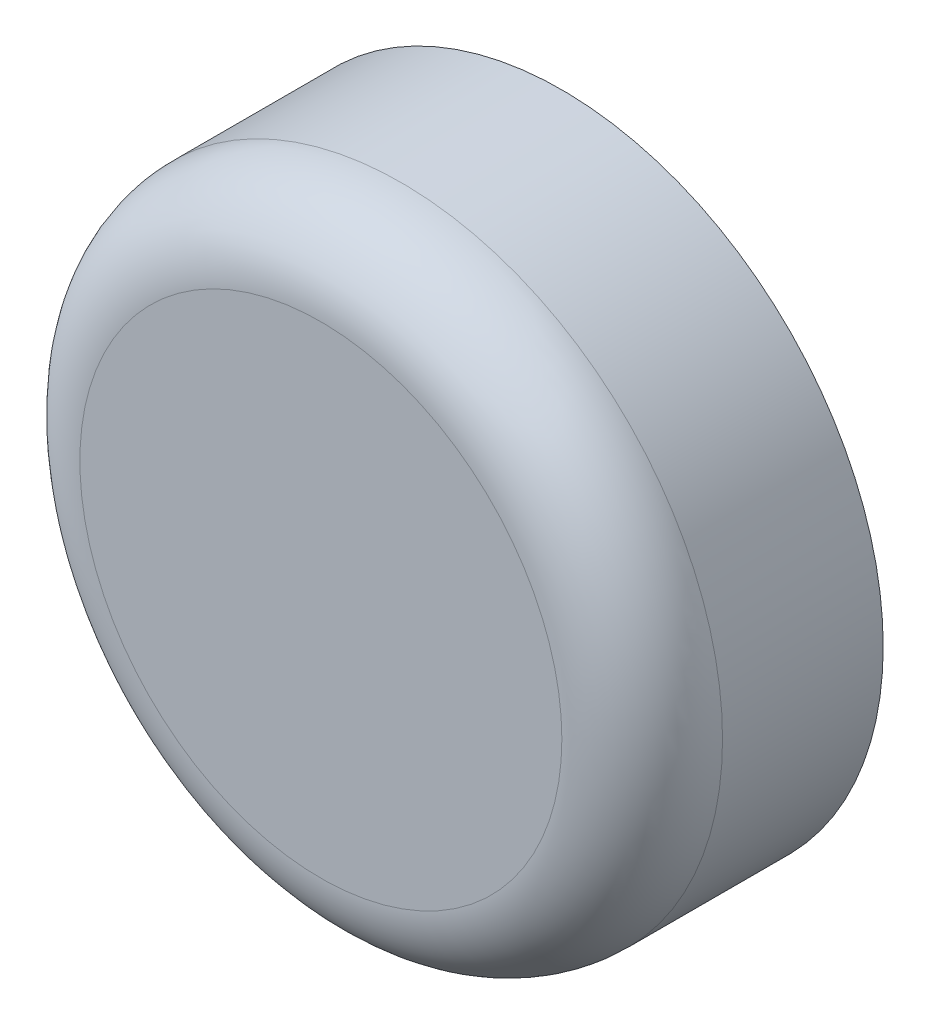
ISO-10303-21;
HEADER;
FILE_DESCRIPTION(('STEP AP214'),'2;1');
FILE_NAME('part.step','',(''),(''),'','','');
FILE_SCHEMA(('AUTOMOTIVE_DESIGN { 1 0 10303 214 1 1 1 1 }'));
ENDSEC;
DATA;
#1=APPLICATION_CONTEXT('core data for automotive mechanical design processes');
#2=APPLICATION_PROTOCOL_DEFINITION('international standard','automotive_design',2000,#1);
#3=PRODUCT_CONTEXT('',#1,'mechanical');
#4=PRODUCT('Part','Part','',(#3));
#5=PRODUCT_RELATED_PRODUCT_CATEGORY('part','',(#4));
#6=PRODUCT_DEFINITION_FORMATION('','',#4);
#7=PRODUCT_DEFINITION_CONTEXT('part definition',#1,'design');
#8=PRODUCT_DEFINITION('design','',#6,#7);
#9=PRODUCT_DEFINITION_SHAPE('','',#8);
#10=(LENGTH_UNIT() NAMED_UNIT(*) SI_UNIT(.MILLI.,.METRE.));
#11=(NAMED_UNIT(*) PLANE_ANGLE_UNIT() SI_UNIT($,.RADIAN.));
#12=(NAMED_UNIT(*) SI_UNIT($,.STERADIAN.) SOLID_ANGLE_UNIT());
#13=UNCERTAINTY_MEASURE_WITH_UNIT(LENGTH_MEASURE(1.E-05),#10,'distance_accuracy_value','');
#14=(GEOMETRIC_REPRESENTATION_CONTEXT(3) GLOBAL_UNCERTAINTY_ASSIGNED_CONTEXT((#13)) GLOBAL_UNIT_ASSIGNED_CONTEXT((#10,
#11,#12)) REPRESENTATION_CONTEXT('',''));
#15=CARTESIAN_POINT('',(0.,0.,0.));
#16=DIRECTION('',(0.,0.,1.));
#17=DIRECTION('',(1.,0.,0.));
#18=AXIS2_PLACEMENT_3D('',#15,#16,#17);
#19=CARTESIAN_POINT('',(0.,0.,0.));
#20=DIRECTION('',(0.,0.,1.));
#21=DIRECTION('',(1.,0.,0.));
#22=AXIS2_PLACEMENT_3D('',#19,#20,#21);
#23=PLANE('',#22);
#24=CARTESIAN_POINT('',(-13.,0.,0.));
#25=DIRECTION('',(0.,0.,-1.));
#26=DIRECTION('',(-1.,0.,0.));
#27=AXIS2_PLACEMENT_3D('',#24,#25,#26);
#28=CIRCLE('',#27,1.25);
#29=CARTESIAN_POINT('',(-14.25,0.,0.));
#30=VERTEX_POINT('',#29);
#31=EDGE_CURVE('E173',#30,#30,#28,.T.);
#32=ORIENTED_EDGE('',*,*,#31,.F.);
#33=EDGE_LOOP('',(#32));
#34=FACE_BOUND('',#33,.T.);
#35=CARTESIAN_POINT('',(0.,0.,0.));
#36=DIRECTION('',(0.,0.,1.));
#37=DIRECTION('',(1.,0.,0.));
#38=AXIS2_PLACEMENT_3D('',#35,#36,#37);
#39=CIRCLE('',#38,20.);
#40=CARTESIAN_POINT('',(20.,0.,0.));
#41=VERTEX_POINT('',#40);
#42=EDGE_CURVE('E113',#41,#41,#39,.T.);
#43=ORIENTED_EDGE('',*,*,#42,.F.);
#44=EDGE_LOOP('',(#43));
#45=FACE_BOUND('',#44,.T.);
#46=DIRECTION('',(1.,0.,0.));
#47=VECTOR('',#46,1.);
#48=CARTESIAN_POINT('',(5.,12.5,0.));
#49=LINE('',#48,#47);
#50=CARTESIAN_POINT('',(-5.,12.5,0.));
#51=VERTEX_POINT('',#50);
#52=CARTESIAN_POINT('',(5.,12.5,0.));
#53=VERTEX_POINT('',#52);
#54=EDGE_CURVE('E85',#51,#53,#49,.T.);
#55=ORIENTED_EDGE('',*,*,#54,.F.);
#56=DIRECTION('',(0.,1.,0.));
#57=VECTOR('',#56,1.);
#58=CARTESIAN_POINT('',(-5.,-12.5,0.));
#59=LINE('',#58,#57);
#60=CARTESIAN_POINT('',(-5.,-12.5,0.));
#61=VERTEX_POINT('',#60);
#62=EDGE_CURVE('E50',#61,#51,#59,.T.);
#63=ORIENTED_EDGE('',*,*,#62,.F.);
#64=DIRECTION('',(-1.,0.,0.));
#65=VECTOR('',#64,1.);
#66=CARTESIAN_POINT('',(5.,-12.5,0.));
#67=LINE('',#66,#65);
#68=CARTESIAN_POINT('',(5.,-12.5,0.));
#69=VERTEX_POINT('',#68);
#70=EDGE_CURVE('E101',#69,#61,#67,.T.);
#71=ORIENTED_EDGE('',*,*,#70,.F.);
#72=DIRECTION('',(0.,-1.,0.));
#73=VECTOR('',#72,1.);
#74=CARTESIAN_POINT('',(5.,-12.5,0.));
#75=LINE('',#74,#73);
#76=EDGE_CURVE('E109',#53,#69,#75,.T.);
#77=ORIENTED_EDGE('',*,*,#76,.F.);
#78=EDGE_LOOP('',(#55,#63,#71,#77));
#79=FACE_BOUND('',#78,.T.);
#80=CARTESIAN_POINT('',(13.,0.,0.));
#81=DIRECTION('',(0.,0.,-1.));
#82=DIRECTION('',(-1.,0.,0.));
#83=AXIS2_PLACEMENT_3D('',#80,#81,#82);
#84=CIRCLE('',#83,1.25);
#85=CARTESIAN_POINT('',(11.75,0.,0.));
#86=VERTEX_POINT('',#85);
#87=EDGE_CURVE('E172',#86,#86,#84,.F.);
#88=ORIENTED_EDGE('',*,*,#87,.T.);
#89=EDGE_LOOP('',(#88));
#90=FACE_BOUND('',#89,.T.);
#91=ADVANCED_FACE('F35',(#34,#45,#79,#90),#23,.F.);
#92=CARTESIAN_POINT('',(0.,0.,15.));
#93=DIRECTION('',(0.,0.,-1.));
#94=DIRECTION('',(-1.,0.,0.));
#95=AXIS2_PLACEMENT_3D('',#92,#93,#94);
#96=CYLINDRICAL_SURFACE('',#95,20.);
#97=CARTESIAN_POINT('',(0.,0.,10.));
#98=DIRECTION('',(0.,0.,1.));
#99=DIRECTION('',(1.,0.,0.));
#100=AXIS2_PLACEMENT_3D('',#97,#98,#99);
#101=CIRCLE('',#100,20.);
#102=CARTESIAN_POINT('',(20.,0.,10.));
#103=VERTEX_POINT('',#102);
#104=EDGE_CURVE('E11',#103,#103,#101,.F.);
#105=ORIENTED_EDGE('',*,*,#104,.T.);
#106=EDGE_LOOP('',(#105));
#107=FACE_BOUND('',#106,.T.);
#108=ORIENTED_EDGE('',*,*,#42,.T.);
#109=EDGE_LOOP('',(#108));
#110=FACE_BOUND('',#109,.T.);
#111=ADVANCED_FACE('F131',(#107,#110),#96,.T.);
#112=CARTESIAN_POINT('',(0.,0.,15.));
#113=DIRECTION('',(0.,0.,1.));
#114=DIRECTION('',(1.,0.,0.));
#115=AXIS2_PLACEMENT_3D('',#112,#113,#114);
#116=PLANE('',#115);
#117=CARTESIAN_POINT('',(0.,0.,15.));
#118=DIRECTION('',(0.,0.,1.));
#119=DIRECTION('',(1.,0.,0.));
#120=AXIS2_PLACEMENT_3D('',#117,#118,#119);
#121=CIRCLE('',#120,15.);
#122=CARTESIAN_POINT('',(15.,0.,15.));
#123=VERTEX_POINT('',#122);
#124=EDGE_CURVE('E43',#123,#123,#121,.T.);
#125=ORIENTED_EDGE('',*,*,#124,.T.);
#126=EDGE_LOOP('',(#125));
#127=FACE_BOUND('',#126,.T.);
#128=ADVANCED_FACE('F120',(#127),#116,.T.);
#129=CARTESIAN_POINT('',(0.,0.,10.));
#130=DIRECTION('',(0.,0.,1.));
#131=DIRECTION('',(1.,0.,0.));
#132=AXIS2_PLACEMENT_3D('',#129,#130,#131);
#133=TOROIDAL_SURFACE('',#132,15.,5.);
#134=ORIENTED_EDGE('',*,*,#104,.F.);
#135=EDGE_LOOP('',(#134));
#136=FACE_BOUND('',#135,.T.);
#137=ORIENTED_EDGE('',*,*,#124,.F.);
#138=EDGE_LOOP('',(#137));
#139=FACE_BOUND('',#138,.T.);
#140=ADVANCED_FACE('F37',(#136,#139),#133,.T.);
#141=CARTESIAN_POINT('',(-5.,-12.5,10.));
#142=DIRECTION('',(-1.,0.,0.));
#143=DIRECTION('',(0.,0.,1.));
#144=AXIS2_PLACEMENT_3D('',#141,#142,#143);
#145=PLANE('',#144);
#146=ORIENTED_EDGE('',*,*,#62,.T.);
#147=DIRECTION('',(0.,0.,-1.));
#148=VECTOR('',#147,1.);
#149=CARTESIAN_POINT('',(-5.,12.5,10.));
#150=LINE('',#149,#148);
#151=CARTESIAN_POINT('',(-5.,12.5,10.));
#152=VERTEX_POINT('',#151);
#153=EDGE_CURVE('E73',#152,#51,#150,.T.);
#154=ORIENTED_EDGE('',*,*,#153,.F.);
#155=DIRECTION('',(0.,1.,0.));
#156=VECTOR('',#155,1.);
#157=CARTESIAN_POINT('',(-5.,-12.5,10.));
#158=LINE('',#157,#156);
#159=CARTESIAN_POINT('',(-5.,-12.5,10.));
#160=VERTEX_POINT('',#159);
#161=EDGE_CURVE('E99',#160,#152,#158,.T.);
#162=ORIENTED_EDGE('',*,*,#161,.F.);
#163=DIRECTION('',(0.,0.,-1.));
#164=VECTOR('',#163,1.);
#165=CARTESIAN_POINT('',(-5.,-12.5,10.));
#166=LINE('',#165,#164);
#167=EDGE_CURVE('E58',#160,#61,#166,.T.);
#168=ORIENTED_EDGE('',*,*,#167,.T.);
#169=EDGE_LOOP('',(#146,#154,#162,#168));
#170=FACE_BOUND('',#169,.T.);
#171=ADVANCED_FACE('F123',(#170),#145,.F.);
#172=CARTESIAN_POINT('',(5.,-12.5,10.));
#173=DIRECTION('',(0.,-1.,0.));
#174=DIRECTION('',(0.,0.,-1.));
#175=AXIS2_PLACEMENT_3D('',#172,#173,#174);
#176=PLANE('',#175);
#177=ORIENTED_EDGE('',*,*,#70,.T.);
#178=ORIENTED_EDGE('',*,*,#167,.F.);
#179=DIRECTION('',(-1.,0.,0.));
#180=VECTOR('',#179,1.);
#181=CARTESIAN_POINT('',(5.,-12.5,10.));
#182=LINE('',#181,#180);
#183=CARTESIAN_POINT('',(5.,-12.5,10.));
#184=VERTEX_POINT('',#183);
#185=EDGE_CURVE('E96',#184,#160,#182,.T.);
#186=ORIENTED_EDGE('',*,*,#185,.F.);
#187=DIRECTION('',(0.,0.,-1.));
#188=VECTOR('',#187,1.);
#189=CARTESIAN_POINT('',(5.,-12.5,10.));
#190=LINE('',#189,#188);
#191=EDGE_CURVE('E89',#184,#69,#190,.T.);
#192=ORIENTED_EDGE('',*,*,#191,.T.);
#193=EDGE_LOOP('',(#177,#178,#186,#192));
#194=FACE_BOUND('',#193,.T.);
#195=ADVANCED_FACE('F129',(#194),#176,.F.);
#196=CARTESIAN_POINT('',(5.,-12.5,10.));
#197=DIRECTION('',(1.,0.,0.));
#198=DIRECTION('',(0.,0.,-1.));
#199=AXIS2_PLACEMENT_3D('',#196,#197,#198);
#200=PLANE('',#199);
#201=ORIENTED_EDGE('',*,*,#76,.T.);
#202=ORIENTED_EDGE('',*,*,#191,.F.);
#203=DIRECTION('',(0.,-1.,0.));
#204=VECTOR('',#203,1.);
#205=CARTESIAN_POINT('',(5.,-12.5,10.));
#206=LINE('',#205,#204);
#207=CARTESIAN_POINT('',(5.,12.5,10.));
#208=VERTEX_POINT('',#207);
#209=EDGE_CURVE('E92',#208,#184,#206,.T.);
#210=ORIENTED_EDGE('',*,*,#209,.F.);
#211=DIRECTION('',(0.,0.,-1.));
#212=VECTOR('',#211,1.);
#213=CARTESIAN_POINT('',(5.,12.5,10.));
#214=LINE('',#213,#212);
#215=EDGE_CURVE('E78',#208,#53,#214,.T.);
#216=ORIENTED_EDGE('',*,*,#215,.T.);
#217=EDGE_LOOP('',(#201,#202,#210,#216));
#218=FACE_BOUND('',#217,.T.);
#219=ADVANCED_FACE('F93',(#218),#200,.F.);
#220=CARTESIAN_POINT('',(5.,12.5,10.));
#221=DIRECTION('',(0.,1.,0.));
#222=DIRECTION('',(0.,0.,1.));
#223=AXIS2_PLACEMENT_3D('',#220,#221,#222);
#224=PLANE('',#223);
#225=ORIENTED_EDGE('',*,*,#54,.T.);
#226=ORIENTED_EDGE('',*,*,#215,.F.);
#227=DIRECTION('',(1.,0.,0.));
#228=VECTOR('',#227,1.);
#229=CARTESIAN_POINT('',(5.,12.5,10.));
#230=LINE('',#229,#228);
#231=EDGE_CURVE('E82',#152,#208,#230,.T.);
#232=ORIENTED_EDGE('',*,*,#231,.F.);
#233=ORIENTED_EDGE('',*,*,#153,.T.);
#234=EDGE_LOOP('',(#225,#226,#232,#233));
#235=FACE_BOUND('',#234,.T.);
#236=ADVANCED_FACE('F80',(#235),#224,.F.);
#237=CARTESIAN_POINT('',(0.,0.,10.));
#238=DIRECTION('',(0.,0.,1.));
#239=DIRECTION('',(1.,0.,0.));
#240=AXIS2_PLACEMENT_3D('',#237,#238,#239);
#241=PLANE('',#240);
#242=ORIENTED_EDGE('',*,*,#161,.T.);
#243=ORIENTED_EDGE('',*,*,#231,.T.);
#244=ORIENTED_EDGE('',*,*,#209,.T.);
#245=ORIENTED_EDGE('',*,*,#185,.T.);
#246=EDGE_LOOP('',(#242,#243,#244,#245));
#247=FACE_BOUND('',#246,.T.);
#248=ADVANCED_FACE('F98',(#247),#241,.F.);
#249=CARTESIAN_POINT('',(13.,0.,5.));
#250=DIRECTION('',(0.,0.,-1.));
#251=DIRECTION('',(-1.,0.,0.));
#252=AXIS2_PLACEMENT_3D('',#249,#250,#251);
#253=CYLINDRICAL_SURFACE('',#252,1.25);
#254=CARTESIAN_POINT('',(13.,0.,5.));
#255=DIRECTION('',(0.,0.,-1.));
#256=DIRECTION('',(-1.,0.,0.));
#257=AXIS2_PLACEMENT_3D('',#254,#255,#256);
#258=CIRCLE('',#257,1.25);
#259=CARTESIAN_POINT('',(11.75,0.,5.));
#260=VERTEX_POINT('',#259);
#261=EDGE_CURVE('E107',#260,#260,#258,.F.);
#262=ORIENTED_EDGE('',*,*,#261,.T.);
#263=EDGE_LOOP('',(#262));
#264=FACE_BOUND('',#263,.T.);
#265=ORIENTED_EDGE('',*,*,#87,.F.);
#266=EDGE_LOOP('',(#265));
#267=FACE_BOUND('',#266,.T.);
#268=ADVANCED_FACE('F152',(#264,#267),#253,.F.);
#269=CARTESIAN_POINT('',(0.,0.,5.));
#270=DIRECTION('',(0.,0.,-1.));
#271=DIRECTION('',(-1.,0.,0.));
#272=AXIS2_PLACEMENT_3D('',#269,#270,#271);
#273=PLANE('',#272);
#274=ORIENTED_EDGE('',*,*,#261,.F.);
#275=EDGE_LOOP('',(#274));
#276=FACE_BOUND('',#275,.T.);
#277=ADVANCED_FACE('F155',(#276),#273,.T.);
#278=CARTESIAN_POINT('',(-13.,0.,5.));
#279=DIRECTION('',(0.,0.,-1.));
#280=DIRECTION('',(-1.,0.,0.));
#281=AXIS2_PLACEMENT_3D('',#278,#279,#280);
#282=CYLINDRICAL_SURFACE('',#281,1.25);
#283=CARTESIAN_POINT('',(-13.,0.,5.));
#284=DIRECTION('',(0.,0.,-1.));
#285=DIRECTION('',(-1.,0.,0.));
#286=AXIS2_PLACEMENT_3D('',#283,#284,#285);
#287=CIRCLE('',#286,1.25);
#288=CARTESIAN_POINT('',(-14.25,0.,5.));
#289=VERTEX_POINT('',#288);
#290=EDGE_CURVE('E171',#289,#289,#287,.T.);
#291=ORIENTED_EDGE('',*,*,#290,.F.);
#292=EDGE_LOOP('',(#291));
#293=FACE_BOUND('',#292,.T.);
#294=ORIENTED_EDGE('',*,*,#31,.T.);
#295=EDGE_LOOP('',(#294));
#296=FACE_BOUND('',#295,.T.);
#297=ADVANCED_FACE('F159',(#293,#296),#282,.F.);
#298=CARTESIAN_POINT('',(0.,0.,5.));
#299=DIRECTION('',(0.,0.,-1.));
#300=DIRECTION('',(-1.,0.,0.));
#301=AXIS2_PLACEMENT_3D('',#298,#299,#300);
#302=PLANE('',#301);
#303=ORIENTED_EDGE('',*,*,#290,.T.);
#304=EDGE_LOOP('',(#303));
#305=FACE_BOUND('',#304,.T.);
#306=ADVANCED_FACE('F163',(#305),#302,.T.);
#307=CLOSED_SHELL('',(#91,#111,#128,#140,#171,#195,#219,#236,#248,#268,#277,#297,#306));
#308=MANIFOLD_SOLID_BREP('B2',#307);
#309=ADVANCED_BREP_SHAPE_REPRESENTATION('',(#18,#308),#14);
#310=SHAPE_DEFINITION_REPRESENTATION(#9,#309);
ENDSEC;
END-ISO-10303-21;
